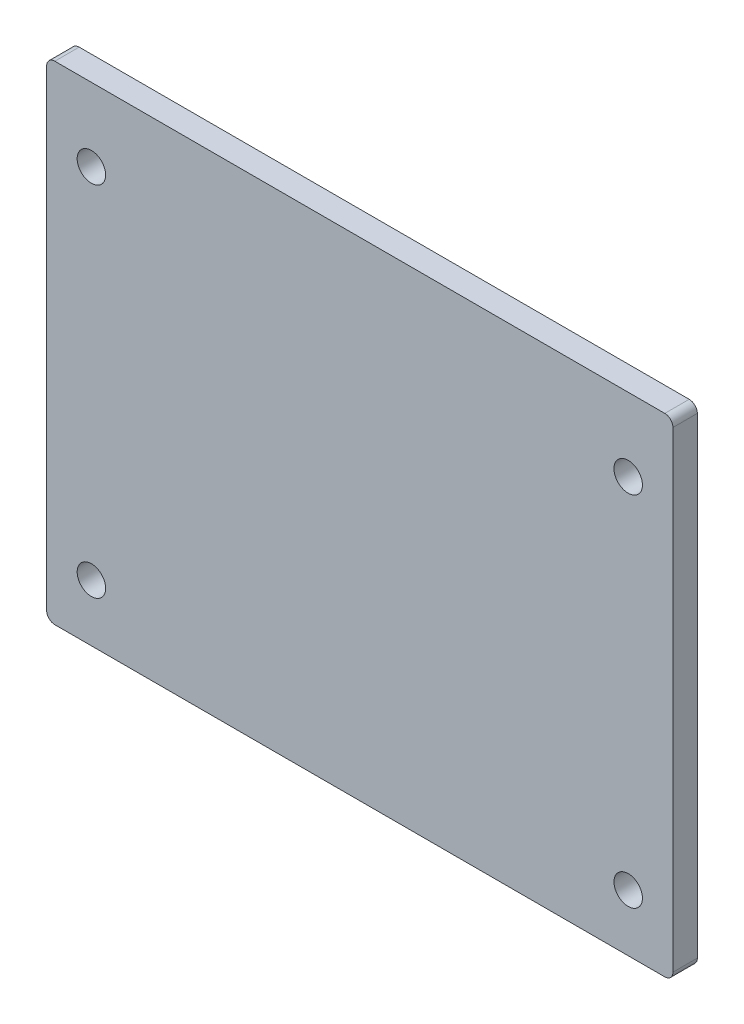
ISO-10303-21;
HEADER;
FILE_DESCRIPTION(('STEP AP214'),'2;1');
FILE_NAME('part.step','',(''),(''),'','','');
FILE_SCHEMA(('AUTOMOTIVE_DESIGN { 1 0 10303 214 1 1 1 1 }'));
ENDSEC;
DATA;
#1=APPLICATION_CONTEXT('core data for automotive mechanical design processes');
#2=APPLICATION_PROTOCOL_DEFINITION('international standard','automotive_design',2000,#1);
#3=PRODUCT_CONTEXT('',#1,'mechanical');
#4=PRODUCT('Part','Part','',(#3));
#5=PRODUCT_RELATED_PRODUCT_CATEGORY('part','',(#4));
#6=PRODUCT_DEFINITION_FORMATION('','',#4);
#7=PRODUCT_DEFINITION_CONTEXT('part definition',#1,'design');
#8=PRODUCT_DEFINITION('design','',#6,#7);
#9=PRODUCT_DEFINITION_SHAPE('','',#8);
#10=(LENGTH_UNIT() NAMED_UNIT(*) SI_UNIT(.MILLI.,.METRE.));
#11=(NAMED_UNIT(*) PLANE_ANGLE_UNIT() SI_UNIT($,.RADIAN.));
#12=(NAMED_UNIT(*) SI_UNIT($,.STERADIAN.) SOLID_ANGLE_UNIT());
#13=UNCERTAINTY_MEASURE_WITH_UNIT(LENGTH_MEASURE(1.E-05),#10,'distance_accuracy_value','');
#14=(GEOMETRIC_REPRESENTATION_CONTEXT(3) GLOBAL_UNCERTAINTY_ASSIGNED_CONTEXT((#13)) GLOBAL_UNIT_ASSIGNED_CONTEXT((#10,
#11,#12)) REPRESENTATION_CONTEXT('',''));
#15=CARTESIAN_POINT('',(0.,0.,0.));
#16=DIRECTION('',(0.,0.,1.));
#17=DIRECTION('',(1.,0.,0.));
#18=AXIS2_PLACEMENT_3D('',#15,#16,#17);
#19=CARTESIAN_POINT('',(0.,0.,3.));
#20=DIRECTION('',(0.,0.,1.));
#21=DIRECTION('',(1.,0.,0.));
#22=AXIS2_PLACEMENT_3D('',#19,#20,#21);
#23=PLANE('',#22);
#24=CARTESIAN_POINT('',(33.,21.,3.));
#25=DIRECTION('',(0.,0.,1.));
#26=DIRECTION('',(1.,0.,0.));
#27=AXIS2_PLACEMENT_3D('',#24,#25,#26);
#28=CIRCLE('',#27,1.75);
#29=CARTESIAN_POINT('',(34.75,21.,3.));
#30=VERTEX_POINT('',#29);
#31=EDGE_CURVE('E186',#30,#30,#28,.T.);
#32=ORIENTED_EDGE('',*,*,#31,.F.);
#33=EDGE_LOOP('',(#32));
#34=FACE_BOUND('',#33,.T.);
#35=CARTESIAN_POINT('',(33.,-23.,3.));
#36=DIRECTION('',(0.,0.,1.));
#37=DIRECTION('',(1.,0.,0.));
#38=AXIS2_PLACEMENT_3D('',#35,#36,#37);
#39=CIRCLE('',#38,1.75);
#40=CARTESIAN_POINT('',(34.75,-23.,3.));
#41=VERTEX_POINT('',#40);
#42=EDGE_CURVE('E132',#41,#41,#39,.T.);
#43=ORIENTED_EDGE('',*,*,#42,.F.);
#44=EDGE_LOOP('',(#43));
#45=FACE_BOUND('',#44,.T.);
#46=DIRECTION('',(0.,1.,0.));
#47=VECTOR('',#46,1.);
#48=CARTESIAN_POINT('',(38.5,-30.,3.));
#49=LINE('',#48,#47);
#50=CARTESIAN_POINT('',(38.5,-29.,3.));
#51=VERTEX_POINT('',#50);
#52=CARTESIAN_POINT('',(38.5,29.,3.));
#53=VERTEX_POINT('',#52);
#54=EDGE_CURVE('E137',#51,#53,#49,.T.);
#55=ORIENTED_EDGE('',*,*,#54,.T.);
#56=CARTESIAN_POINT('',(37.5,29.,3.));
#57=DIRECTION('',(0.,0.,1.));
#58=DIRECTION('',(1.,0.,0.));
#59=AXIS2_PLACEMENT_3D('',#56,#57,#58);
#60=CIRCLE('',#59,1.);
#61=CARTESIAN_POINT('',(37.5,30.,3.));
#62=VERTEX_POINT('',#61);
#63=EDGE_CURVE('E152',#53,#62,#60,.T.);
#64=ORIENTED_EDGE('',*,*,#63,.T.);
#65=DIRECTION('',(-1.,0.,0.));
#66=VECTOR('',#65,1.);
#67=CARTESIAN_POINT('',(38.5,30.,3.));
#68=LINE('',#67,#66);
#69=CARTESIAN_POINT('',(-37.5,30.,3.));
#70=VERTEX_POINT('',#69);
#71=EDGE_CURVE('E119',#62,#70,#68,.T.);
#72=ORIENTED_EDGE('',*,*,#71,.T.);
#73=CARTESIAN_POINT('',(-37.5,29.,3.));
#74=DIRECTION('',(0.,0.,1.));
#75=DIRECTION('',(1.,0.,0.));
#76=AXIS2_PLACEMENT_3D('',#73,#74,#75);
#77=CIRCLE('',#76,1.);
#78=CARTESIAN_POINT('',(-38.5,29.,3.));
#79=VERTEX_POINT('',#78);
#80=EDGE_CURVE('E147',#70,#79,#77,.T.);
#81=ORIENTED_EDGE('',*,*,#80,.T.);
#82=DIRECTION('',(0.,-1.,0.));
#83=VECTOR('',#82,1.);
#84=CARTESIAN_POINT('',(-38.5,-30.,3.));
#85=LINE('',#84,#83);
#86=CARTESIAN_POINT('',(-38.5,-29.,3.));
#87=VERTEX_POINT('',#86);
#88=EDGE_CURVE('E163',#79,#87,#85,.T.);
#89=ORIENTED_EDGE('',*,*,#88,.T.);
#90=CARTESIAN_POINT('',(-37.5,-29.,3.));
#91=DIRECTION('',(0.,0.,1.));
#92=DIRECTION('',(1.,0.,0.));
#93=AXIS2_PLACEMENT_3D('',#90,#91,#92);
#94=CIRCLE('',#93,1.);
#95=CARTESIAN_POINT('',(-37.5,-30.,3.));
#96=VERTEX_POINT('',#95);
#97=EDGE_CURVE('E55',#87,#96,#94,.T.);
#98=ORIENTED_EDGE('',*,*,#97,.T.);
#99=DIRECTION('',(1.,0.,0.));
#100=VECTOR('',#99,1.);
#101=CARTESIAN_POINT('',(38.5,-30.,3.));
#102=LINE('',#101,#100);
#103=CARTESIAN_POINT('',(37.5,-30.,3.));
#104=VERTEX_POINT('',#103);
#105=EDGE_CURVE('E138',#96,#104,#102,.T.);
#106=ORIENTED_EDGE('',*,*,#105,.T.);
#107=CARTESIAN_POINT('',(37.5,-29.,3.));
#108=DIRECTION('',(0.,0.,1.));
#109=DIRECTION('',(1.,0.,0.));
#110=AXIS2_PLACEMENT_3D('',#107,#108,#109);
#111=CIRCLE('',#110,1.);
#112=EDGE_CURVE('E150',#104,#51,#111,.T.);
#113=ORIENTED_EDGE('',*,*,#112,.T.);
#114=EDGE_LOOP('',(#55,#64,#72,#81,#89,#98,#106,#113));
#115=FACE_BOUND('',#114,.T.);
#116=CARTESIAN_POINT('',(-33.,-23.,3.));
#117=DIRECTION('',(0.,0.,1.));
#118=DIRECTION('',(1.,0.,0.));
#119=AXIS2_PLACEMENT_3D('',#116,#117,#118);
#120=CIRCLE('',#119,1.75000000000001);
#121=CARTESIAN_POINT('',(-31.25,-23.,3.));
#122=VERTEX_POINT('',#121);
#123=EDGE_CURVE('E180',#122,#122,#120,.T.);
#124=ORIENTED_EDGE('',*,*,#123,.F.);
#125=EDGE_LOOP('',(#124));
#126=FACE_BOUND('',#125,.T.);
#127=CARTESIAN_POINT('',(-33.,21.,3.));
#128=DIRECTION('',(0.,0.,1.));
#129=DIRECTION('',(1.,0.,0.));
#130=AXIS2_PLACEMENT_3D('',#127,#128,#129);
#131=CIRCLE('',#130,1.75000000000002);
#132=CARTESIAN_POINT('',(-31.25,21.,3.));
#133=VERTEX_POINT('',#132);
#134=EDGE_CURVE('E192',#133,#133,#131,.T.);
#135=ORIENTED_EDGE('',*,*,#134,.F.);
#136=EDGE_LOOP('',(#135));
#137=FACE_BOUND('',#136,.T.);
#138=ADVANCED_FACE('F33',(#34,#45,#115,#126,#137),#23,.T.);
#139=CARTESIAN_POINT('',(0.,0.,0.));
#140=DIRECTION('',(0.,0.,1.));
#141=DIRECTION('',(1.,0.,0.));
#142=AXIS2_PLACEMENT_3D('',#139,#140,#141);
#143=PLANE('',#142);
#144=DIRECTION('',(-1.,0.,0.));
#145=VECTOR('',#144,1.);
#146=CARTESIAN_POINT('',(38.5,30.,0.));
#147=LINE('',#146,#145);
#148=CARTESIAN_POINT('',(37.5,30.,0.));
#149=VERTEX_POINT('',#148);
#150=CARTESIAN_POINT('',(-37.5,30.,0.));
#151=VERTEX_POINT('',#150);
#152=EDGE_CURVE('E116',#149,#151,#147,.T.);
#153=ORIENTED_EDGE('',*,*,#152,.F.);
#154=CARTESIAN_POINT('',(37.5,29.,0.));
#155=DIRECTION('',(0.,0.,1.));
#156=DIRECTION('',(1.,0.,0.));
#157=AXIS2_PLACEMENT_3D('',#154,#155,#156);
#158=CIRCLE('',#157,1.);
#159=CARTESIAN_POINT('',(38.5,29.,0.));
#160=VERTEX_POINT('',#159);
#161=EDGE_CURVE('E99',#149,#160,#158,.F.);
#162=ORIENTED_EDGE('',*,*,#161,.T.);
#163=DIRECTION('',(0.,1.,0.));
#164=VECTOR('',#163,1.);
#165=CARTESIAN_POINT('',(38.5,-30.,0.));
#166=LINE('',#165,#164);
#167=CARTESIAN_POINT('',(38.5,-29.,0.));
#168=VERTEX_POINT('',#167);
#169=EDGE_CURVE('E127',#168,#160,#166,.T.);
#170=ORIENTED_EDGE('',*,*,#169,.F.);
#171=CARTESIAN_POINT('',(37.5,-29.,0.));
#172=DIRECTION('',(0.,0.,1.));
#173=DIRECTION('',(1.,0.,0.));
#174=AXIS2_PLACEMENT_3D('',#171,#172,#173);
#175=CIRCLE('',#174,1.);
#176=CARTESIAN_POINT('',(37.5,-30.,0.));
#177=VERTEX_POINT('',#176);
#178=EDGE_CURVE('E110',#168,#177,#175,.F.);
#179=ORIENTED_EDGE('',*,*,#178,.T.);
#180=DIRECTION('',(1.,0.,0.));
#181=VECTOR('',#180,1.);
#182=CARTESIAN_POINT('',(38.5,-30.,0.));
#183=LINE('',#182,#181);
#184=CARTESIAN_POINT('',(-37.5,-30.,0.));
#185=VERTEX_POINT('',#184);
#186=EDGE_CURVE('E130',#185,#177,#183,.T.);
#187=ORIENTED_EDGE('',*,*,#186,.F.);
#188=CARTESIAN_POINT('',(-37.5,-29.,0.));
#189=DIRECTION('',(0.,0.,1.));
#190=DIRECTION('',(1.,0.,0.));
#191=AXIS2_PLACEMENT_3D('',#188,#189,#190);
#192=CIRCLE('',#191,1.);
#193=CARTESIAN_POINT('',(-38.5,-29.,0.));
#194=VERTEX_POINT('',#193);
#195=EDGE_CURVE('E141',#185,#194,#192,.F.);
#196=ORIENTED_EDGE('',*,*,#195,.T.);
#197=DIRECTION('',(0.,-1.,0.));
#198=VECTOR('',#197,1.);
#199=CARTESIAN_POINT('',(-38.5,-30.,0.));
#200=LINE('',#199,#198);
#201=CARTESIAN_POINT('',(-38.5,29.,0.));
#202=VERTEX_POINT('',#201);
#203=EDGE_CURVE('E126',#202,#194,#200,.T.);
#204=ORIENTED_EDGE('',*,*,#203,.F.);
#205=CARTESIAN_POINT('',(-37.5,29.,0.));
#206=DIRECTION('',(0.,0.,1.));
#207=DIRECTION('',(1.,0.,0.));
#208=AXIS2_PLACEMENT_3D('',#205,#206,#207);
#209=CIRCLE('',#208,1.);
#210=EDGE_CURVE('E120',#202,#151,#209,.F.);
#211=ORIENTED_EDGE('',*,*,#210,.T.);
#212=EDGE_LOOP('',(#153,#162,#170,#179,#187,#196,#204,#211));
#213=FACE_BOUND('',#212,.T.);
#214=CARTESIAN_POINT('',(33.,-23.,0.));
#215=DIRECTION('',(0.,0.,1.));
#216=DIRECTION('',(1.,0.,0.));
#217=AXIS2_PLACEMENT_3D('',#214,#215,#216);
#218=CIRCLE('',#217,1.75);
#219=CARTESIAN_POINT('',(34.75,-23.,0.));
#220=VERTEX_POINT('',#219);
#221=EDGE_CURVE('E177',#220,#220,#218,.T.);
#222=ORIENTED_EDGE('',*,*,#221,.T.);
#223=EDGE_LOOP('',(#222));
#224=FACE_BOUND('',#223,.T.);
#225=CARTESIAN_POINT('',(-33.,-23.,0.));
#226=DIRECTION('',(0.,0.,1.));
#227=DIRECTION('',(1.,0.,0.));
#228=AXIS2_PLACEMENT_3D('',#225,#226,#227);
#229=CIRCLE('',#228,1.75000000000001);
#230=CARTESIAN_POINT('',(-31.25,-23.,0.));
#231=VERTEX_POINT('',#230);
#232=EDGE_CURVE('E183',#231,#231,#229,.T.);
#233=ORIENTED_EDGE('',*,*,#232,.T.);
#234=EDGE_LOOP('',(#233));
#235=FACE_BOUND('',#234,.T.);
#236=CARTESIAN_POINT('',(33.,21.,0.));
#237=DIRECTION('',(0.,0.,1.));
#238=DIRECTION('',(1.,0.,0.));
#239=AXIS2_PLACEMENT_3D('',#236,#237,#238);
#240=CIRCLE('',#239,1.75);
#241=CARTESIAN_POINT('',(34.75,21.,0.));
#242=VERTEX_POINT('',#241);
#243=EDGE_CURVE('E189',#242,#242,#240,.T.);
#244=ORIENTED_EDGE('',*,*,#243,.T.);
#245=EDGE_LOOP('',(#244));
#246=FACE_BOUND('',#245,.T.);
#247=CARTESIAN_POINT('',(-33.,21.,0.));
#248=DIRECTION('',(0.,0.,1.));
#249=DIRECTION('',(1.,0.,0.));
#250=AXIS2_PLACEMENT_3D('',#247,#248,#249);
#251=CIRCLE('',#250,1.75000000000002);
#252=CARTESIAN_POINT('',(-31.25,21.,0.));
#253=VERTEX_POINT('',#252);
#254=EDGE_CURVE('E195',#253,#253,#251,.T.);
#255=ORIENTED_EDGE('',*,*,#254,.T.);
#256=EDGE_LOOP('',(#255));
#257=FACE_BOUND('',#256,.T.);
#258=ADVANCED_FACE('F123',(#213,#224,#235,#246,#257),#143,.F.);
#259=CARTESIAN_POINT('',(38.5,-30.,3.));
#260=DIRECTION('',(-1.,0.,0.));
#261=DIRECTION('',(0.,0.,1.));
#262=AXIS2_PLACEMENT_3D('',#259,#260,#261);
#263=PLANE('',#262);
#264=ORIENTED_EDGE('',*,*,#169,.T.);
#265=DIRECTION('',(0.,0.,-1.));
#266=VECTOR('',#265,1.);
#267=CARTESIAN_POINT('',(38.5,29.,3.));
#268=LINE('',#267,#266);
#269=EDGE_CURVE('E104',#160,#53,#268,.F.);
#270=ORIENTED_EDGE('',*,*,#269,.T.);
#271=ORIENTED_EDGE('',*,*,#54,.F.);
#272=DIRECTION('',(0.,0.,-1.));
#273=VECTOR('',#272,1.);
#274=CARTESIAN_POINT('',(38.5,-29.,3.));
#275=LINE('',#274,#273);
#276=EDGE_CURVE('E109',#51,#168,#275,.T.);
#277=ORIENTED_EDGE('',*,*,#276,.T.);
#278=EDGE_LOOP('',(#264,#270,#271,#277));
#279=FACE_BOUND('',#278,.T.);
#280=ADVANCED_FACE('F211',(#279),#263,.F.);
#281=CARTESIAN_POINT('',(38.5,30.,3.));
#282=DIRECTION('',(0.,-1.,0.));
#283=DIRECTION('',(0.,0.,-1.));
#284=AXIS2_PLACEMENT_3D('',#281,#282,#283);
#285=PLANE('',#284);
#286=ORIENTED_EDGE('',*,*,#71,.F.);
#287=DIRECTION('',(0.,0.,-1.));
#288=VECTOR('',#287,1.);
#289=CARTESIAN_POINT('',(37.5,30.,3.));
#290=LINE('',#289,#288);
#291=EDGE_CURVE('E103',#62,#149,#290,.T.);
#292=ORIENTED_EDGE('',*,*,#291,.T.);
#293=ORIENTED_EDGE('',*,*,#152,.T.);
#294=DIRECTION('',(0.,0.,-1.));
#295=VECTOR('',#294,1.);
#296=CARTESIAN_POINT('',(-37.5,30.,3.));
#297=LINE('',#296,#295);
#298=EDGE_CURVE('E121',#151,#70,#297,.F.);
#299=ORIENTED_EDGE('',*,*,#298,.T.);
#300=EDGE_LOOP('',(#286,#292,#293,#299));
#301=FACE_BOUND('',#300,.T.);
#302=ADVANCED_FACE('F115',(#301),#285,.F.);
#303=CARTESIAN_POINT('',(-38.5,-30.,3.));
#304=DIRECTION('',(1.,0.,0.));
#305=DIRECTION('',(0.,0.,-1.));
#306=AXIS2_PLACEMENT_3D('',#303,#304,#305);
#307=PLANE('',#306);
#308=ORIENTED_EDGE('',*,*,#203,.T.);
#309=DIRECTION('',(0.,0.,-1.));
#310=VECTOR('',#309,1.);
#311=CARTESIAN_POINT('',(-38.5,-29.,3.));
#312=LINE('',#311,#310);
#313=EDGE_CURVE('E11',#194,#87,#312,.F.);
#314=ORIENTED_EDGE('',*,*,#313,.T.);
#315=ORIENTED_EDGE('',*,*,#88,.F.);
#316=DIRECTION('',(0.,0.,-1.));
#317=VECTOR('',#316,1.);
#318=CARTESIAN_POINT('',(-38.5,29.,3.));
#319=LINE('',#318,#317);
#320=EDGE_CURVE('E41',#79,#202,#319,.T.);
#321=ORIENTED_EDGE('',*,*,#320,.T.);
#322=EDGE_LOOP('',(#308,#314,#315,#321));
#323=FACE_BOUND('',#322,.T.);
#324=ADVANCED_FACE('F161',(#323),#307,.F.);
#325=CARTESIAN_POINT('',(38.5,-30.,3.));
#326=DIRECTION('',(0.,1.,0.));
#327=DIRECTION('',(0.,0.,1.));
#328=AXIS2_PLACEMENT_3D('',#325,#326,#327);
#329=PLANE('',#328);
#330=ORIENTED_EDGE('',*,*,#186,.T.);
#331=DIRECTION('',(0.,0.,-1.));
#332=VECTOR('',#331,1.);
#333=CARTESIAN_POINT('',(37.5,-30.,3.));
#334=LINE('',#333,#332);
#335=EDGE_CURVE('E48',#177,#104,#334,.F.);
#336=ORIENTED_EDGE('',*,*,#335,.T.);
#337=ORIENTED_EDGE('',*,*,#105,.F.);
#338=DIRECTION('',(0.,0.,-1.));
#339=VECTOR('',#338,1.);
#340=CARTESIAN_POINT('',(-37.5,-30.,3.));
#341=LINE('',#340,#339);
#342=EDGE_CURVE('E154',#96,#185,#341,.T.);
#343=ORIENTED_EDGE('',*,*,#342,.T.);
#344=EDGE_LOOP('',(#330,#336,#337,#343));
#345=FACE_BOUND('',#344,.T.);
#346=ADVANCED_FACE('F170',(#345),#329,.F.);
#347=CARTESIAN_POINT('',(33.,-23.,3.));
#348=DIRECTION('',(0.,0.,-1.));
#349=DIRECTION('',(-1.,0.,0.));
#350=AXIS2_PLACEMENT_3D('',#347,#348,#349);
#351=CYLINDRICAL_SURFACE('',#350,1.75);
#352=ORIENTED_EDGE('',*,*,#42,.T.);
#353=EDGE_LOOP('',(#352));
#354=FACE_BOUND('',#353,.T.);
#355=ORIENTED_EDGE('',*,*,#221,.F.);
#356=EDGE_LOOP('',(#355));
#357=FACE_BOUND('',#356,.T.);
#358=ADVANCED_FACE('F216',(#354,#357),#351,.F.);
#359=CARTESIAN_POINT('',(-33.,-23.,3.));
#360=DIRECTION('',(0.,0.,-1.));
#361=DIRECTION('',(-1.,0.,0.));
#362=AXIS2_PLACEMENT_3D('',#359,#360,#361);
#363=CYLINDRICAL_SURFACE('',#362,1.75000000000001);
#364=ORIENTED_EDGE('',*,*,#123,.T.);
#365=EDGE_LOOP('',(#364));
#366=FACE_BOUND('',#365,.T.);
#367=ORIENTED_EDGE('',*,*,#232,.F.);
#368=EDGE_LOOP('',(#367));
#369=FACE_BOUND('',#368,.T.);
#370=ADVANCED_FACE('F244',(#366,#369),#363,.F.);
#371=CARTESIAN_POINT('',(33.,21.,3.));
#372=DIRECTION('',(0.,0.,-1.));
#373=DIRECTION('',(-1.,0.,0.));
#374=AXIS2_PLACEMENT_3D('',#371,#372,#373);
#375=CYLINDRICAL_SURFACE('',#374,1.75);
#376=ORIENTED_EDGE('',*,*,#31,.T.);
#377=EDGE_LOOP('',(#376));
#378=FACE_BOUND('',#377,.T.);
#379=ORIENTED_EDGE('',*,*,#243,.F.);
#380=EDGE_LOOP('',(#379));
#381=FACE_BOUND('',#380,.T.);
#382=ADVANCED_FACE('F247',(#378,#381),#375,.F.);
#383=CARTESIAN_POINT('',(-33.,21.,3.));
#384=DIRECTION('',(0.,0.,-1.));
#385=DIRECTION('',(-1.,0.,0.));
#386=AXIS2_PLACEMENT_3D('',#383,#384,#385);
#387=CYLINDRICAL_SURFACE('',#386,1.75000000000002);
#388=ORIENTED_EDGE('',*,*,#134,.T.);
#389=EDGE_LOOP('',(#388));
#390=FACE_BOUND('',#389,.T.);
#391=ORIENTED_EDGE('',*,*,#254,.F.);
#392=EDGE_LOOP('',(#391));
#393=FACE_BOUND('',#392,.T.);
#394=ADVANCED_FACE('F201',(#390,#393),#387,.F.);
#395=CARTESIAN_POINT('',(37.5,29.,3.));
#396=DIRECTION('',(0.,0.,-1.));
#397=DIRECTION('',(-1.,0.,0.));
#398=AXIS2_PLACEMENT_3D('',#395,#396,#397);
#399=CYLINDRICAL_SURFACE('',#398,1.);
#400=ORIENTED_EDGE('',*,*,#63,.F.);
#401=ORIENTED_EDGE('',*,*,#269,.F.);
#402=ORIENTED_EDGE('',*,*,#161,.F.);
#403=ORIENTED_EDGE('',*,*,#291,.F.);
#404=EDGE_LOOP('',(#400,#401,#402,#403));
#405=FACE_BOUND('',#404,.T.);
#406=ADVANCED_FACE('F102',(#405),#399,.T.);
#407=CARTESIAN_POINT('',(37.5,-29.,3.));
#408=DIRECTION('',(0.,0.,-1.));
#409=DIRECTION('',(-1.,0.,0.));
#410=AXIS2_PLACEMENT_3D('',#407,#408,#409);
#411=CYLINDRICAL_SURFACE('',#410,1.);
#412=ORIENTED_EDGE('',*,*,#112,.F.);
#413=ORIENTED_EDGE('',*,*,#335,.F.);
#414=ORIENTED_EDGE('',*,*,#178,.F.);
#415=ORIENTED_EDGE('',*,*,#276,.F.);
#416=EDGE_LOOP('',(#412,#413,#414,#415));
#417=FACE_BOUND('',#416,.T.);
#418=ADVANCED_FACE('F230',(#417),#411,.T.);
#419=CARTESIAN_POINT('',(-37.5,-29.,3.));
#420=DIRECTION('',(0.,0.,-1.));
#421=DIRECTION('',(-1.,0.,0.));
#422=AXIS2_PLACEMENT_3D('',#419,#420,#421);
#423=CYLINDRICAL_SURFACE('',#422,1.);
#424=ORIENTED_EDGE('',*,*,#97,.F.);
#425=ORIENTED_EDGE('',*,*,#313,.F.);
#426=ORIENTED_EDGE('',*,*,#195,.F.);
#427=ORIENTED_EDGE('',*,*,#342,.F.);
#428=EDGE_LOOP('',(#424,#425,#426,#427));
#429=FACE_BOUND('',#428,.T.);
#430=ADVANCED_FACE('F169',(#429),#423,.T.);
#431=CARTESIAN_POINT('',(-37.5,29.,3.));
#432=DIRECTION('',(0.,0.,-1.));
#433=DIRECTION('',(-1.,0.,0.));
#434=AXIS2_PLACEMENT_3D('',#431,#432,#433);
#435=CYLINDRICAL_SURFACE('',#434,1.);
#436=ORIENTED_EDGE('',*,*,#80,.F.);
#437=ORIENTED_EDGE('',*,*,#298,.F.);
#438=ORIENTED_EDGE('',*,*,#210,.F.);
#439=ORIENTED_EDGE('',*,*,#320,.F.);
#440=EDGE_LOOP('',(#436,#437,#438,#439));
#441=FACE_BOUND('',#440,.T.);
#442=ADVANCED_FACE('F35',(#441),#435,.T.);
#443=CLOSED_SHELL('',(#138,#258,#280,#302,#324,#346,#358,#370,#382,#394,#406,#418,#430,#442));
#444=MANIFOLD_SOLID_BREP('B2',#443);
#445=ADVANCED_BREP_SHAPE_REPRESENTATION('',(#18,#444),#14);
#446=SHAPE_DEFINITION_REPRESENTATION(#9,#445);
ENDSEC;
END-ISO-10303-21;
